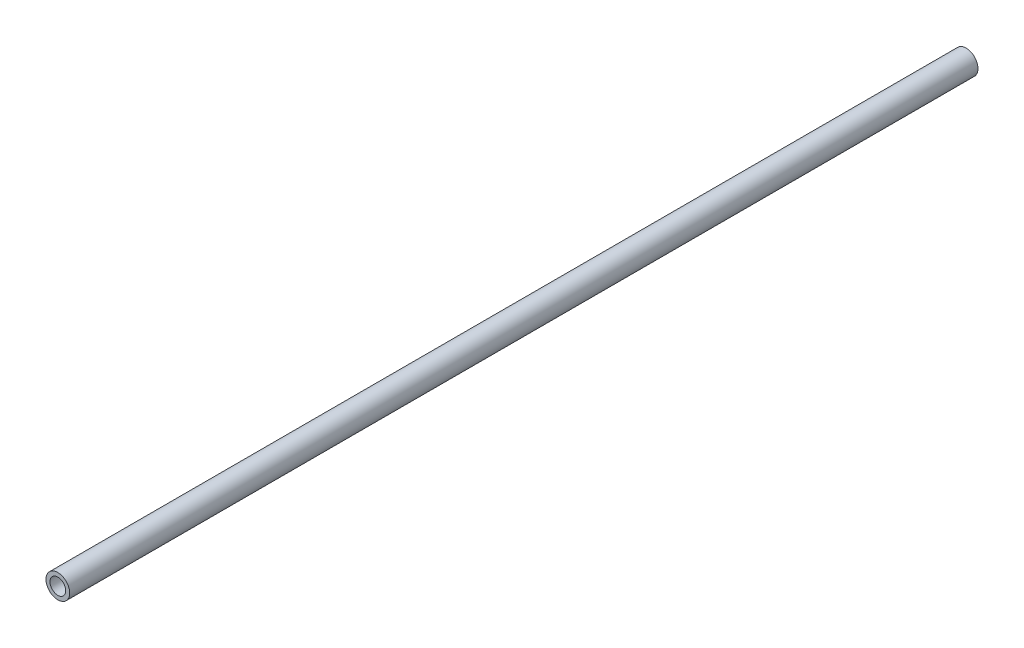
ISO-10303-21;
HEADER;
FILE_DESCRIPTION(('STEP AP214'),'2;1');
FILE_NAME('part.step','',(''),(''),'','','');
FILE_SCHEMA(('AUTOMOTIVE_DESIGN { 1 0 10303 214 1 1 1 1 }'));
ENDSEC;
DATA;
#1=APPLICATION_CONTEXT('core data for automotive mechanical design processes');
#2=APPLICATION_PROTOCOL_DEFINITION('international standard','automotive_design',2000,#1);
#3=PRODUCT_CONTEXT('',#1,'mechanical');
#4=PRODUCT('Part','Part','',(#3));
#5=PRODUCT_RELATED_PRODUCT_CATEGORY('part','',(#4));
#6=PRODUCT_DEFINITION_FORMATION('','',#4);
#7=PRODUCT_DEFINITION_CONTEXT('part definition',#1,'design');
#8=PRODUCT_DEFINITION('design','',#6,#7);
#9=PRODUCT_DEFINITION_SHAPE('','',#8);
#10=(LENGTH_UNIT() NAMED_UNIT(*) SI_UNIT(.MILLI.,.METRE.));
#11=(NAMED_UNIT(*) PLANE_ANGLE_UNIT() SI_UNIT($,.RADIAN.));
#12=(NAMED_UNIT(*) SI_UNIT($,.STERADIAN.) SOLID_ANGLE_UNIT());
#13=UNCERTAINTY_MEASURE_WITH_UNIT(LENGTH_MEASURE(1.E-05),#10,'distance_accuracy_value','');
#14=(GEOMETRIC_REPRESENTATION_CONTEXT(3) GLOBAL_UNCERTAINTY_ASSIGNED_CONTEXT((#13)) GLOBAL_UNIT_ASSIGNED_CONTEXT((#10,
#11,#12)) REPRESENTATION_CONTEXT('',''));
#15=CARTESIAN_POINT('',(0.,0.,0.));
#16=DIRECTION('',(0.,0.,1.));
#17=DIRECTION('',(1.,0.,0.));
#18=AXIS2_PLACEMENT_3D('',#15,#16,#17);
#19=CARTESIAN_POINT('',(0.,0.,584.2));
#20=DIRECTION('',(0.,0.,1.));
#21=DIRECTION('',(1.,0.,0.));
#22=AXIS2_PLACEMENT_3D('',#19,#20,#21);
#23=PLANE('',#22);
#24=CARTESIAN_POINT('',(0.,0.,584.2));
#25=DIRECTION('',(0.,0.,1.));
#26=DIRECTION('',(1.,0.,0.));
#27=AXIS2_PLACEMENT_3D('',#24,#25,#26);
#28=CIRCLE('',#27,7.62);
#29=CARTESIAN_POINT('',(7.62,0.,584.2));
#30=VERTEX_POINT('',#29);
#31=EDGE_CURVE('E10',#30,#30,#28,.T.);
#32=ORIENTED_EDGE('',*,*,#31,.T.);
#33=EDGE_LOOP('',(#32));
#34=FACE_BOUND('',#33,.T.);
#35=CARTESIAN_POINT('',(0.,0.,584.2));
#36=DIRECTION('',(0.,0.,1.));
#37=DIRECTION('',(1.,0.,0.));
#38=AXIS2_PLACEMENT_3D('',#35,#36,#37);
#39=CIRCLE('',#38,5.08);
#40=CARTESIAN_POINT('',(5.08,0.,584.2));
#41=VERTEX_POINT('',#40);
#42=EDGE_CURVE('E41',#41,#41,#39,.T.);
#43=ORIENTED_EDGE('',*,*,#42,.F.);
#44=EDGE_LOOP('',(#43));
#45=FACE_BOUND('',#44,.T.);
#46=ADVANCED_FACE('F30',(#34,#45),#23,.T.);
#47=CARTESIAN_POINT('',(0.,0.,0.));
#48=DIRECTION('',(0.,0.,1.));
#49=DIRECTION('',(1.,0.,0.));
#50=AXIS2_PLACEMENT_3D('',#47,#48,#49);
#51=PLANE('',#50);
#52=CARTESIAN_POINT('',(0.,0.,0.));
#53=DIRECTION('',(0.,0.,1.));
#54=DIRECTION('',(1.,0.,0.));
#55=AXIS2_PLACEMENT_3D('',#52,#53,#54);
#56=CIRCLE('',#55,7.62);
#57=CARTESIAN_POINT('',(7.62,0.,0.));
#58=VERTEX_POINT('',#57);
#59=EDGE_CURVE('E34',#58,#58,#56,.T.);
#60=ORIENTED_EDGE('',*,*,#59,.F.);
#61=EDGE_LOOP('',(#60));
#62=FACE_BOUND('',#61,.T.);
#63=CARTESIAN_POINT('',(0.,0.,0.));
#64=DIRECTION('',(0.,0.,1.));
#65=DIRECTION('',(1.,0.,0.));
#66=AXIS2_PLACEMENT_3D('',#63,#64,#65);
#67=CIRCLE('',#66,5.08);
#68=CARTESIAN_POINT('',(5.08,0.,0.));
#69=VERTEX_POINT('',#68);
#70=EDGE_CURVE('E43',#69,#69,#67,.T.);
#71=ORIENTED_EDGE('',*,*,#70,.T.);
#72=EDGE_LOOP('',(#71));
#73=FACE_BOUND('',#72,.T.);
#74=ADVANCED_FACE('F53',(#62,#73),#51,.F.);
#75=CARTESIAN_POINT('',(0.,0.,584.2));
#76=DIRECTION('',(0.,0.,-1.));
#77=DIRECTION('',(-1.,0.,0.));
#78=AXIS2_PLACEMENT_3D('',#75,#76,#77);
#79=CYLINDRICAL_SURFACE('',#78,7.62);
#80=ORIENTED_EDGE('',*,*,#31,.F.);
#81=EDGE_LOOP('',(#80));
#82=FACE_BOUND('',#81,.T.);
#83=ORIENTED_EDGE('',*,*,#59,.T.);
#84=EDGE_LOOP('',(#83));
#85=FACE_BOUND('',#84,.T.);
#86=ADVANCED_FACE('F32',(#82,#85),#79,.T.);
#87=CARTESIAN_POINT('',(0.,0.,584.2));
#88=DIRECTION('',(0.,0.,-1.));
#89=DIRECTION('',(-1.,0.,0.));
#90=AXIS2_PLACEMENT_3D('',#87,#88,#89);
#91=CYLINDRICAL_SURFACE('',#90,5.08);
#92=ORIENTED_EDGE('',*,*,#42,.T.);
#93=EDGE_LOOP('',(#92));
#94=FACE_BOUND('',#93,.T.);
#95=ORIENTED_EDGE('',*,*,#70,.F.);
#96=EDGE_LOOP('',(#95));
#97=FACE_BOUND('',#96,.T.);
#98=ADVANCED_FACE('F49',(#94,#97),#91,.F.);
#99=CLOSED_SHELL('',(#46,#74,#86,#98));
#100=MANIFOLD_SOLID_BREP('B2',#99);
#101=ADVANCED_BREP_SHAPE_REPRESENTATION('',(#18,#100),#14);
#102=SHAPE_DEFINITION_REPRESENTATION(#9,#101);
ENDSEC;
END-ISO-10303-21;
